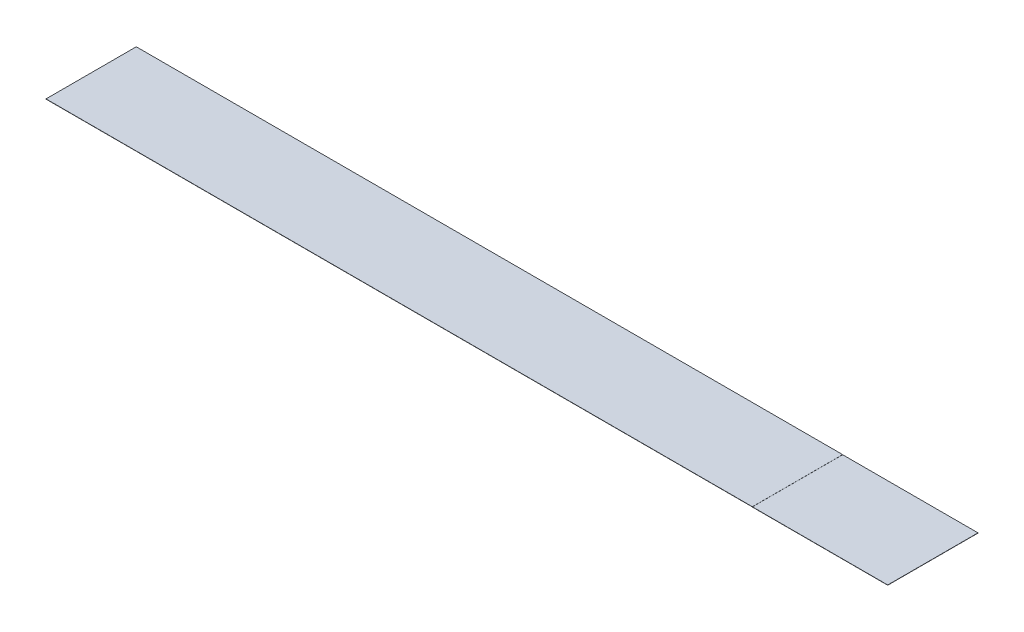
ISO-10303-21;
HEADER;
FILE_DESCRIPTION(('STEP AP214'),'2;1');
FILE_NAME('part.step','',(''),(''),'','','');
FILE_SCHEMA(('AUTOMOTIVE_DESIGN { 1 0 10303 214 1 1 1 1 }'));
ENDSEC;
DATA;
#1=APPLICATION_CONTEXT('core data for automotive mechanical design processes');
#2=APPLICATION_PROTOCOL_DEFINITION('international standard','automotive_design',2000,#1);
#3=PRODUCT_CONTEXT('',#1,'mechanical');
#4=PRODUCT('Part','Part','',(#3));
#5=PRODUCT_RELATED_PRODUCT_CATEGORY('part','',(#4));
#6=PRODUCT_DEFINITION_FORMATION('','',#4);
#7=PRODUCT_DEFINITION_CONTEXT('part definition',#1,'design');
#8=PRODUCT_DEFINITION('design','',#6,#7);
#9=PRODUCT_DEFINITION_SHAPE('','',#8);
#10=(LENGTH_UNIT() NAMED_UNIT(*) SI_UNIT(.MILLI.,.METRE.));
#11=(NAMED_UNIT(*) PLANE_ANGLE_UNIT() SI_UNIT($,.RADIAN.));
#12=(NAMED_UNIT(*) SI_UNIT($,.STERADIAN.) SOLID_ANGLE_UNIT());
#13=UNCERTAINTY_MEASURE_WITH_UNIT(LENGTH_MEASURE(1.E-05),#10,'distance_accuracy_value','');
#14=(GEOMETRIC_REPRESENTATION_CONTEXT(3) GLOBAL_UNCERTAINTY_ASSIGNED_CONTEXT((#13)) GLOBAL_UNIT_ASSIGNED_CONTEXT((#10,
#11,#12)) REPRESENTATION_CONTEXT('',''));
#15=CARTESIAN_POINT('',(0.,0.,0.));
#16=DIRECTION('',(0.,0.,1.));
#17=DIRECTION('',(1.,0.,0.));
#18=AXIS2_PLACEMENT_3D('',#15,#16,#17);
#19=CARTESIAN_POINT('',(-264.4,0.15,-30.5));
#20=DIRECTION('',(0.,0.,1.));
#21=DIRECTION('',(1.,0.,0.));
#22=AXIS2_PLACEMENT_3D('',#19,#20,#21);
#23=PLANE('',#22);
#24=DIRECTION('',(-1.,0.,0.));
#25=VECTOR('',#24,1.);
#26=CARTESIAN_POINT('',(-264.4,0.15,-30.5));
#27=LINE('',#26,#25);
#28=CARTESIAN_POINT('',(192.95,0.15,-30.5));
#29=VERTEX_POINT('',#28);
#30=CARTESIAN_POINT('',(-284.4,0.15,-30.5));
#31=VERTEX_POINT('',#30);
#32=EDGE_CURVE('E133',#29,#31,#27,.T.);
#33=ORIENTED_EDGE('',*,*,#32,.F.);
#34=DIRECTION('',(0.,1.,0.));
#35=VECTOR('',#34,1.);
#36=CARTESIAN_POINT('',(192.95,0.15,-30.5));
#37=LINE('',#36,#35);
#38=CARTESIAN_POINT('',(192.95,0.08142,-30.5));
#39=VERTEX_POINT('',#38);
#40=EDGE_CURVE('E107',#39,#29,#37,.T.);
#41=ORIENTED_EDGE('',*,*,#40,.F.);
#42=DIRECTION('',(-1.,0.,0.));
#43=VECTOR('',#42,1.);
#44=CARTESIAN_POINT('',(284.4,0.08142,-30.5));
#45=LINE('',#44,#43);
#46=CARTESIAN_POINT('',(284.4,0.08142,-30.5));
#47=VERTEX_POINT('',#46);
#48=EDGE_CURVE('E98',#47,#39,#45,.T.);
#49=ORIENTED_EDGE('',*,*,#48,.F.);
#50=DIRECTION('',(0.,1.,0.));
#51=VECTOR('',#50,1.);
#52=CARTESIAN_POINT('',(284.4,-64.1950153828161,-30.5));
#53=LINE('',#52,#51);
#54=CARTESIAN_POINT('',(284.4,-0.0685799999999999,-30.5));
#55=VERTEX_POINT('',#54);
#56=EDGE_CURVE('E105',#55,#47,#53,.T.);
#57=ORIENTED_EDGE('',*,*,#56,.F.);
#58=DIRECTION('',(-1.,0.,0.));
#59=VECTOR('',#58,1.);
#60=CARTESIAN_POINT('',(192.95,-0.06858,-30.5));
#61=LINE('',#60,#59);
#62=CARTESIAN_POINT('',(192.95,-0.06858,-30.5));
#63=VERTEX_POINT('',#62);
#64=EDGE_CURVE('E119',#55,#63,#61,.T.);
#65=ORIENTED_EDGE('',*,*,#64,.T.);
#66=DIRECTION('',(0.,1.,0.));
#67=VECTOR('',#66,1.);
#68=CARTESIAN_POINT('',(192.95,0.,-30.5));
#69=LINE('',#68,#67);
#70=CARTESIAN_POINT('',(192.95,0.,-30.5));
#71=VERTEX_POINT('',#70);
#72=EDGE_CURVE('E153',#63,#71,#69,.T.);
#73=ORIENTED_EDGE('',*,*,#72,.T.);
#74=DIRECTION('',(-1.,0.,0.));
#75=VECTOR('',#74,1.);
#76=CARTESIAN_POINT('',(-264.4,0.,-30.5));
#77=LINE('',#76,#75);
#78=CARTESIAN_POINT('',(-284.4,0.,-30.5));
#79=VERTEX_POINT('',#78);
#80=EDGE_CURVE('E126',#71,#79,#77,.T.);
#81=ORIENTED_EDGE('',*,*,#80,.T.);
#82=DIRECTION('',(0.,1.,0.));
#83=VECTOR('',#82,1.);
#84=CARTESIAN_POINT('',(-284.4,-64.1950153828161,-30.5));
#85=LINE('',#84,#83);
#86=EDGE_CURVE('E117',#79,#31,#85,.T.);
#87=ORIENTED_EDGE('',*,*,#86,.T.);
#88=EDGE_LOOP('',(#33,#41,#49,#57,#65,#73,#81,#87));
#89=FACE_BOUND('',#88,.T.);
#90=ADVANCED_FACE('F33',(#89),#23,.F.);
#91=CARTESIAN_POINT('',(-264.4,0.15,30.5));
#92=DIRECTION('',(0.,0.,-1.));
#93=DIRECTION('',(-1.,0.,0.));
#94=AXIS2_PLACEMENT_3D('',#91,#92,#93);
#95=PLANE('',#94);
#96=DIRECTION('',(-1.,0.,0.));
#97=VECTOR('',#96,1.);
#98=CARTESIAN_POINT('',(-264.4,0.08142,30.5));
#99=LINE('',#98,#97);
#100=CARTESIAN_POINT('',(284.4,0.0814199999999987,30.5));
#101=VERTEX_POINT('',#100);
#102=CARTESIAN_POINT('',(192.95,0.08142,30.5));
#103=VERTEX_POINT('',#102);
#104=EDGE_CURVE('E46',#101,#103,#99,.T.);
#105=ORIENTED_EDGE('',*,*,#104,.T.);
#106=DIRECTION('',(0.,1.,0.));
#107=VECTOR('',#106,1.);
#108=CARTESIAN_POINT('',(192.95,0.15,30.5));
#109=LINE('',#108,#107);
#110=CARTESIAN_POINT('',(192.95,0.15,30.5));
#111=VERTEX_POINT('',#110);
#112=EDGE_CURVE('E147',#103,#111,#109,.T.);
#113=ORIENTED_EDGE('',*,*,#112,.T.);
#114=DIRECTION('',(1.,0.,0.));
#115=VECTOR('',#114,1.);
#116=CARTESIAN_POINT('',(-264.4,0.15,30.5));
#117=LINE('',#116,#115);
#118=CARTESIAN_POINT('',(-284.4,0.15,30.5));
#119=VERTEX_POINT('',#118);
#120=EDGE_CURVE('E40',#119,#111,#117,.T.);
#121=ORIENTED_EDGE('',*,*,#120,.F.);
#122=DIRECTION('',(0.,1.,0.));
#123=VECTOR('',#122,1.);
#124=CARTESIAN_POINT('',(-284.4,-64.1950153828161,30.5));
#125=LINE('',#124,#123);
#126=CARTESIAN_POINT('',(-284.4,0.,30.5));
#127=VERTEX_POINT('',#126);
#128=EDGE_CURVE('E127',#127,#119,#125,.T.);
#129=ORIENTED_EDGE('',*,*,#128,.F.);
#130=DIRECTION('',(1.,0.,0.));
#131=VECTOR('',#130,1.);
#132=CARTESIAN_POINT('',(-264.4,0.,30.5));
#133=LINE('',#132,#131);
#134=CARTESIAN_POINT('',(192.95,0.,30.5));
#135=VERTEX_POINT('',#134);
#136=EDGE_CURVE('E135',#127,#135,#133,.T.);
#137=ORIENTED_EDGE('',*,*,#136,.T.);
#138=DIRECTION('',(0.,-1.,0.));
#139=VECTOR('',#138,1.);
#140=CARTESIAN_POINT('',(192.95,0.,30.5));
#141=LINE('',#140,#139);
#142=CARTESIAN_POINT('',(192.95,-0.06858,30.5));
#143=VERTEX_POINT('',#142);
#144=EDGE_CURVE('E54',#135,#143,#141,.T.);
#145=ORIENTED_EDGE('',*,*,#144,.T.);
#146=DIRECTION('',(1.,0.,0.));
#147=VECTOR('',#146,1.);
#148=CARTESIAN_POINT('',(192.95,-0.06858,30.5));
#149=LINE('',#148,#147);
#150=CARTESIAN_POINT('',(284.4,-0.0685799999999999,30.5));
#151=VERTEX_POINT('',#150);
#152=EDGE_CURVE('E146',#143,#151,#149,.T.);
#153=ORIENTED_EDGE('',*,*,#152,.T.);
#154=DIRECTION('',(0.,1.,0.));
#155=VECTOR('',#154,1.);
#156=CARTESIAN_POINT('',(284.4,-64.1950153828161,30.5));
#157=LINE('',#156,#155);
#158=EDGE_CURVE('E114',#151,#101,#157,.T.);
#159=ORIENTED_EDGE('',*,*,#158,.T.);
#160=EDGE_LOOP('',(#105,#113,#121,#129,#137,#145,#153,#159));
#161=FACE_BOUND('',#160,.T.);
#162=ADVANCED_FACE('F164',(#161),#95,.F.);
#163=CARTESIAN_POINT('',(264.4,0.15,30.5));
#164=DIRECTION('',(0.,1.,0.));
#165=DIRECTION('',(0.,0.,1.));
#166=AXIS2_PLACEMENT_3D('',#163,#164,#165);
#167=PLANE('',#166);
#168=DIRECTION('',(0.,0.,-1.));
#169=VECTOR('',#168,1.);
#170=CARTESIAN_POINT('',(192.95,0.15,30.50005));
#171=LINE('',#170,#169);
#172=EDGE_CURVE('E180',#111,#29,#171,.T.);
#173=ORIENTED_EDGE('',*,*,#172,.T.);
#174=ORIENTED_EDGE('',*,*,#32,.T.);
#175=DIRECTION('',(0.,0.,1.));
#176=VECTOR('',#175,1.);
#177=CARTESIAN_POINT('',(-284.4,0.15,-30.5));
#178=LINE('',#177,#176);
#179=EDGE_CURVE('E113',#31,#119,#178,.T.);
#180=ORIENTED_EDGE('',*,*,#179,.T.);
#181=ORIENTED_EDGE('',*,*,#120,.T.);
#182=EDGE_LOOP('',(#173,#174,#180,#181));
#183=FACE_BOUND('',#182,.T.);
#184=ADVANCED_FACE('F179',(#183),#167,.T.);
#185=CARTESIAN_POINT('',(264.4,0.,30.5));
#186=DIRECTION('',(0.,1.,0.));
#187=DIRECTION('',(0.,0.,1.));
#188=AXIS2_PLACEMENT_3D('',#185,#186,#187);
#189=PLANE('',#188);
#190=ORIENTED_EDGE('',*,*,#80,.F.);
#191=DIRECTION('',(0.,0.,1.));
#192=VECTOR('',#191,1.);
#193=CARTESIAN_POINT('',(192.95,0.,-121.950025714684));
#194=LINE('',#193,#192);
#195=EDGE_CURVE('E150',#71,#135,#194,.T.);
#196=ORIENTED_EDGE('',*,*,#195,.T.);
#197=ORIENTED_EDGE('',*,*,#136,.F.);
#198=DIRECTION('',(0.,0.,-1.));
#199=VECTOR('',#198,1.);
#200=CARTESIAN_POINT('',(-284.4,0.,-30.5));
#201=LINE('',#200,#199);
#202=EDGE_CURVE('E124',#127,#79,#201,.T.);
#203=ORIENTED_EDGE('',*,*,#202,.T.);
#204=EDGE_LOOP('',(#190,#196,#197,#203));
#205=FACE_BOUND('',#204,.T.);
#206=ADVANCED_FACE('F170',(#205),#189,.F.);
#207=CARTESIAN_POINT('',(-284.4,-64.1950153828161,-30.5));
#208=DIRECTION('',(-1.,0.,0.));
#209=DIRECTION('',(0.,0.,1.));
#210=AXIS2_PLACEMENT_3D('',#207,#208,#209);
#211=PLANE('',#210);
#212=ORIENTED_EDGE('',*,*,#202,.F.);
#213=ORIENTED_EDGE('',*,*,#128,.T.);
#214=ORIENTED_EDGE('',*,*,#179,.F.);
#215=ORIENTED_EDGE('',*,*,#86,.F.);
#216=EDGE_LOOP('',(#212,#213,#214,#215));
#217=FACE_BOUND('',#216,.T.);
#218=ADVANCED_FACE('F176',(#217),#211,.T.);
#219=CARTESIAN_POINT('',(284.4,-64.1950153828161,-30.5));
#220=DIRECTION('',(1.,0.,0.));
#221=DIRECTION('',(0.,0.,-1.));
#222=AXIS2_PLACEMENT_3D('',#219,#220,#221);
#223=PLANE('',#222);
#224=DIRECTION('',(0.,0.,-1.));
#225=VECTOR('',#224,1.);
#226=CARTESIAN_POINT('',(284.4,0.0814199999999987,-30.5));
#227=LINE('',#226,#225);
#228=EDGE_CURVE('E11',#101,#47,#227,.T.);
#229=ORIENTED_EDGE('',*,*,#228,.F.);
#230=ORIENTED_EDGE('',*,*,#158,.F.);
#231=DIRECTION('',(0.,0.,1.));
#232=VECTOR('',#231,1.);
#233=CARTESIAN_POINT('',(284.4,-0.0685799999999999,-121.950025714684));
#234=LINE('',#233,#232);
#235=EDGE_CURVE('E111',#55,#151,#234,.T.);
#236=ORIENTED_EDGE('',*,*,#235,.F.);
#237=ORIENTED_EDGE('',*,*,#56,.T.);
#238=EDGE_LOOP('',(#229,#230,#236,#237));
#239=FACE_BOUND('',#238,.T.);
#240=ADVANCED_FACE('F109',(#239),#223,.T.);
#241=CARTESIAN_POINT('',(192.95,0.,-121.950025714684));
#242=DIRECTION('',(-1.,0.,0.));
#243=DIRECTION('',(0.,0.,1.));
#244=AXIS2_PLACEMENT_3D('',#241,#242,#243);
#245=PLANE('',#244);
#246=ORIENTED_EDGE('',*,*,#72,.F.);
#247=DIRECTION('',(0.,0.,1.));
#248=VECTOR('',#247,1.);
#249=CARTESIAN_POINT('',(192.95,-0.06858,-121.950025714684));
#250=LINE('',#249,#248);
#251=EDGE_CURVE('E158',#63,#143,#250,.T.);
#252=ORIENTED_EDGE('',*,*,#251,.T.);
#253=ORIENTED_EDGE('',*,*,#144,.F.);
#254=ORIENTED_EDGE('',*,*,#195,.F.);
#255=EDGE_LOOP('',(#246,#252,#253,#254));
#256=FACE_BOUND('',#255,.T.);
#257=ADVANCED_FACE('F168',(#256),#245,.T.);
#258=CARTESIAN_POINT('',(192.95,-0.06858,-121.950025714684));
#259=DIRECTION('',(0.,-1.,0.));
#260=DIRECTION('',(1.,0.,0.));
#261=AXIS2_PLACEMENT_3D('',#258,#259,#260);
#262=PLANE('',#261);
#263=ORIENTED_EDGE('',*,*,#64,.F.);
#264=ORIENTED_EDGE('',*,*,#235,.T.);
#265=ORIENTED_EDGE('',*,*,#152,.F.);
#266=ORIENTED_EDGE('',*,*,#251,.F.);
#267=EDGE_LOOP('',(#263,#264,#265,#266));
#268=FACE_BOUND('',#267,.T.);
#269=ADVANCED_FACE('F166',(#268),#262,.T.);
#270=CARTESIAN_POINT('',(192.95,0.15,30.50005));
#271=DIRECTION('',(-1.,0.,0.));
#272=DIRECTION('',(0.,0.,1.));
#273=AXIS2_PLACEMENT_3D('',#270,#271,#272);
#274=PLANE('',#273);
#275=DIRECTION('',(0.,0.,-1.));
#276=VECTOR('',#275,1.);
#277=CARTESIAN_POINT('',(192.95,0.08142,30.50005));
#278=LINE('',#277,#276);
#279=EDGE_CURVE('E183',#103,#39,#278,.T.);
#280=ORIENTED_EDGE('',*,*,#279,.T.);
#281=ORIENTED_EDGE('',*,*,#40,.T.);
#282=ORIENTED_EDGE('',*,*,#172,.F.);
#283=ORIENTED_EDGE('',*,*,#112,.F.);
#284=EDGE_LOOP('',(#280,#281,#282,#283));
#285=FACE_BOUND('',#284,.T.);
#286=ADVANCED_FACE('F188',(#285),#274,.F.);
#287=CARTESIAN_POINT('',(284.4,0.08142,30.50005));
#288=DIRECTION('',(0.,-1.,0.));
#289=DIRECTION('',(0.,0.,-1.));
#290=AXIS2_PLACEMENT_3D('',#287,#288,#289);
#291=PLANE('',#290);
#292=ORIENTED_EDGE('',*,*,#228,.T.);
#293=ORIENTED_EDGE('',*,*,#48,.T.);
#294=ORIENTED_EDGE('',*,*,#279,.F.);
#295=ORIENTED_EDGE('',*,*,#104,.F.);
#296=EDGE_LOOP('',(#292,#293,#294,#295));
#297=FACE_BOUND('',#296,.T.);
#298=ADVANCED_FACE('F97',(#297),#291,.F.);
#299=CLOSED_SHELL('',(#90,#162,#184,#206,#218,#240,#257,#269,#286,#298));
#300=MANIFOLD_SOLID_BREP('B2',#299);
#301=ADVANCED_BREP_SHAPE_REPRESENTATION('',(#18,#300),#14);
#302=SHAPE_DEFINITION_REPRESENTATION(#9,#301);
ENDSEC;
END-ISO-10303-21;
